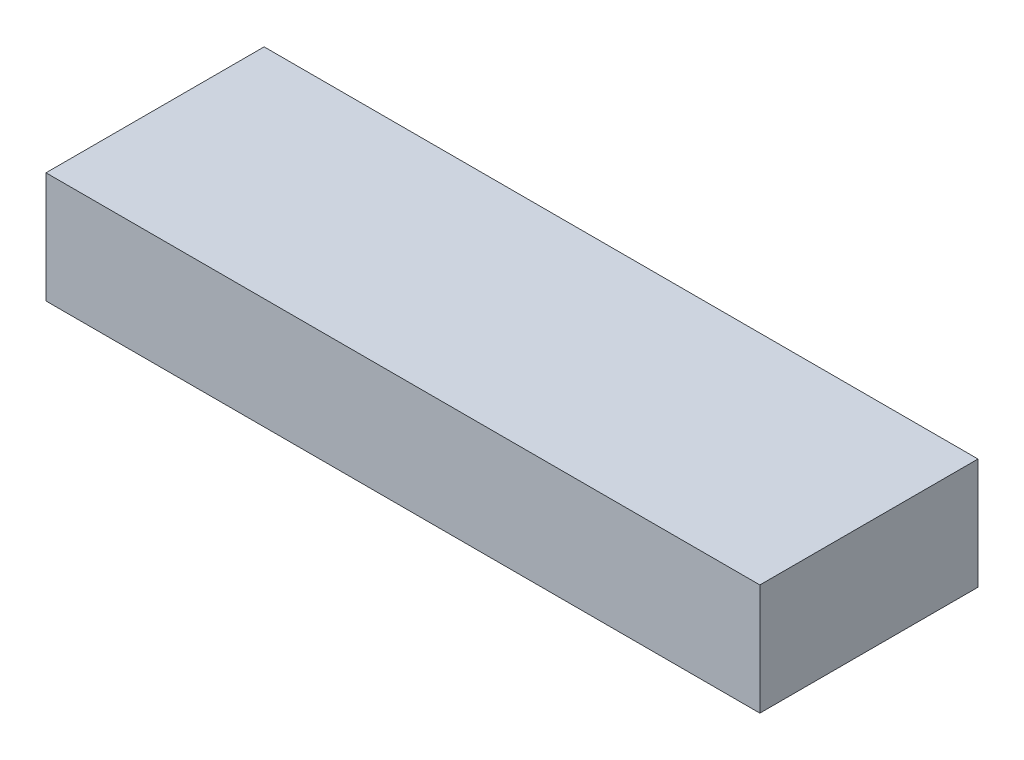
ISO-10303-21;
HEADER;
FILE_DESCRIPTION(('STEP AP214'),'2;1');
FILE_NAME('part.step','',(''),(''),'','','');
FILE_SCHEMA(('AUTOMOTIVE_DESIGN { 1 0 10303 214 1 1 1 1 }'));
ENDSEC;
DATA;
#1=APPLICATION_CONTEXT('core data for automotive mechanical design processes');
#2=APPLICATION_PROTOCOL_DEFINITION('international standard','automotive_design',2000,#1);
#3=PRODUCT_CONTEXT('',#1,'mechanical');
#4=PRODUCT('Part','Part','',(#3));
#5=PRODUCT_RELATED_PRODUCT_CATEGORY('part','',(#4));
#6=PRODUCT_DEFINITION_FORMATION('','',#4);
#7=PRODUCT_DEFINITION_CONTEXT('part definition',#1,'design');
#8=PRODUCT_DEFINITION('design','',#6,#7);
#9=PRODUCT_DEFINITION_SHAPE('','',#8);
#10=(LENGTH_UNIT() NAMED_UNIT(*) SI_UNIT(.MILLI.,.METRE.));
#11=(NAMED_UNIT(*) PLANE_ANGLE_UNIT() SI_UNIT($,.RADIAN.));
#12=(NAMED_UNIT(*) SI_UNIT($,.STERADIAN.) SOLID_ANGLE_UNIT());
#13=UNCERTAINTY_MEASURE_WITH_UNIT(LENGTH_MEASURE(1.E-05),#10,'distance_accuracy_value','');
#14=(GEOMETRIC_REPRESENTATION_CONTEXT(3) GLOBAL_UNCERTAINTY_ASSIGNED_CONTEXT((#13)) GLOBAL_UNIT_ASSIGNED_CONTEXT((#10,
#11,#12)) REPRESENTATION_CONTEXT('',''));
#15=CARTESIAN_POINT('',(0.,0.,0.));
#16=DIRECTION('',(0.,0.,1.));
#17=DIRECTION('',(1.,0.,0.));
#18=AXIS2_PLACEMENT_3D('',#15,#16,#17);
#19=CARTESIAN_POINT('',(0.,263.525,0.));
#20=DIRECTION('',(0.,1.,0.));
#21=DIRECTION('',(0.,0.,1.));
#22=AXIS2_PLACEMENT_3D('',#19,#20,#21);
#23=PLANE('',#22);
#24=DIRECTION('',(1.,0.,0.));
#25=VECTOR('',#24,1.);
#26=CARTESIAN_POINT('',(241.253264434507,263.525,0.));
#27=LINE('',#26,#25);
#28=CARTESIAN_POINT('',(60.,263.525,0.));
#29=VERTEX_POINT('',#28);
#30=CARTESIAN_POINT('',(240.,263.525,0.));
#31=VERTEX_POINT('',#30);
#32=EDGE_CURVE('E38',#29,#31,#27,.T.);
#33=ORIENTED_EDGE('',*,*,#32,.T.);
#34=DIRECTION('',(0.,0.,-1.));
#35=VECTOR('',#34,1.);
#36=CARTESIAN_POINT('',(240.,263.525,0.));
#37=LINE('',#36,#35);
#38=CARTESIAN_POINT('',(240.,263.525,54.9999999999999));
#39=VERTEX_POINT('',#38);
#40=EDGE_CURVE('E119',#39,#31,#37,.T.);
#41=ORIENTED_EDGE('',*,*,#40,.F.);
#42=DIRECTION('',(1.,0.,0.));
#43=VECTOR('',#42,1.);
#44=CARTESIAN_POINT('',(240.,263.525,54.9999999999999));
#45=LINE('',#44,#43);
#46=CARTESIAN_POINT('',(60.0000000000001,263.525,55.));
#47=VERTEX_POINT('',#46);
#48=EDGE_CURVE('E115',#47,#39,#45,.T.);
#49=ORIENTED_EDGE('',*,*,#48,.F.);
#50=DIRECTION('',(0.,0.,1.));
#51=VECTOR('',#50,1.);
#52=CARTESIAN_POINT('',(60.0000000000001,263.525,55.));
#53=LINE('',#52,#51);
#54=EDGE_CURVE('E176',#29,#47,#53,.T.);
#55=ORIENTED_EDGE('',*,*,#54,.F.);
#56=EDGE_LOOP('',(#33,#41,#49,#55));
#57=FACE_BOUND('',#56,.T.);
#58=CARTESIAN_POINT('',(128.409183393375,263.525,37.2754741948869));
#59=CARTESIAN_POINT('',(128.935315344216,263.525,37.2634224363284));
#60=CARTESIAN_POINT('',(129.461491505504,263.525,37.2535435033356));
#61=CARTESIAN_POINT('',(130.513852839061,263.525,37.237426466283));
#62=CARTESIAN_POINT('',(131.040038006218,263.525,37.2311880332933));
#63=CARTESIAN_POINT('',(132.092412602007,263.525,37.2216454362855));
#64=CARTESIAN_POINT('',(132.61860202968,263.525,37.2183411582906));
#65=CARTESIAN_POINT('',(133.670985228738,263.525,37.2140483026083));
#66=CARTESIAN_POINT('',(134.19717900005,263.525,37.2130597054449));
#67=CARTESIAN_POINT('',(135.249572115499,263.525,37.2128345851069));
#68=CARTESIAN_POINT('',(135.775771459634,263.525,37.2135980813797));
#69=CARTESIAN_POINT('',(136.828173533466,263.525,37.2163711429077));
#70=CARTESIAN_POINT('',(137.354376263115,263.525,37.2183807248162));
#71=CARTESIAN_POINT('',(138.406783389086,263.525,37.2231925593134));
#72=CARTESIAN_POINT('',(138.932987785367,263.525,37.2259948201963));
#73=CARTESIAN_POINT('',(139.985396245271,263.525,37.2319931499325));
#74=CARTESIAN_POINT('',(140.511600308883,263.525,37.2351892202885));
#75=CARTESIAN_POINT('',(141.886491043867,263.525,37.2435928187358));
#76=CARTESIAN_POINT('',(142.735177525047,263.525,37.2488326767238));
#77=CARTESIAN_POINT('',(144.432556553816,263.525,37.2582425022373));
#78=CARTESIAN_POINT('',(145.281249101403,263.525,37.2624124701066));
#79=CARTESIAN_POINT('',(146.978632631595,263.525,37.2688930427409));
#80=CARTESIAN_POINT('',(147.827323614121,263.525,37.2712036674703));
#81=CARTESIAN_POINT('',(149.52470899831,263.525,37.2735609607826));
#82=CARTESIAN_POINT('',(150.373403399974,263.525,37.2736076291291));
#83=CARTESIAN_POINT('',(152.070797310421,263.525,37.271429254405));
#84=CARTESIAN_POINT('',(152.919496819173,263.525,37.2692041893922));
#85=CARTESIAN_POINT('',(154.616887765753,263.525,37.2628704112622));
#86=CARTESIAN_POINT('',(155.465579203586,263.525,37.2587616995014));
#87=CARTESIAN_POINT('',(157.162973220721,263.525,37.2494376641435));
#88=CARTESIAN_POINT('',(158.011675799885,263.525,37.2442223174891));
#89=CARTESIAN_POINT('',(159.709081238484,263.525,37.2338343237847));
#90=CARTESIAN_POINT('',(160.557784097918,263.525,37.228661676729));
#91=CARTESIAN_POINT('',(161.972290562856,263.525,37.2213439100927));
#92=CARTESIAN_POINT('',(162.538091764272,263.525,37.2187643559831));
#93=CARTESIAN_POINT('',(163.669696230646,263.525,37.2148419638552));
#94=CARTESIAN_POINT('',(164.235499495582,263.525,37.2134991201338));
#95=CARTESIAN_POINT('',(165.367101258372,263.525,37.2126551063442));
#96=CARTESIAN_POINT('',(165.9328997562,263.525,37.2131539137987));
#97=CARTESIAN_POINT('',(167.064516610619,263.525,37.2166755781878));
#98=CARTESIAN_POINT('',(167.630334966877,263.525,37.219698555104));
#99=CARTESIAN_POINT('',(168.761954151257,263.525,37.2290223167449));
#100=CARTESIAN_POINT('',(169.327754979074,263.525,37.2353231422159));
#101=CARTESIAN_POINT('',(170.459326126803,263.525,37.2520713840699));
#102=CARTESIAN_POINT('',(171.025096443194,263.525,37.2625190343745));
#103=CARTESIAN_POINT('',(171.590816606616,263.525,37.2754741948862));
#104=B_SPLINE_CURVE_WITH_KNOTS('',3,(#58,#59,#60,#61,#62,#63,#64,#65,#66,#67,#68,#69,#70,#71,
#72,#73,#74,#75,#76,#77,#78,#79,#80,#81,#82,#83,#84,#85,#86,#87,#88,#89,#90,#91,#92,#93,#94,#95,
#96,#97,#98,#99,#100,#101,#102,#103),.UNSPECIFIED.,.F.,.F.,(4,2,2,2,2,2,2,2,2,2,2,2,2,2,2,2,2,2,
2,2,2,2,4),(0.,1.57879740934248,3.1574521475984,4.73604556052074,6.31462569662369,
7.89322335427828,9.47184210937685,11.0504773829365,12.6291186801294,15.1752265693772,
17.7213336406751,20.2674133730744,22.8134933712835,25.3595979617897,27.9057007187842,
30.4518565303839,32.9980120064225,34.6954324514137,36.3928450686892,38.0902369692669,
39.7877095567272,41.4852032456054,43.1827927034092),.UNSPECIFIED.);
#105=CARTESIAN_POINT('',(128.409183393374,263.525,37.2754741948869));
#106=VERTEX_POINT('',#105);
#107=CARTESIAN_POINT('',(171.590816606617,263.525,37.2754741948862));
#108=VERTEX_POINT('',#107);
#109=EDGE_CURVE('E43',#106,#108,#104,.T.);
#110=ORIENTED_EDGE('',*,*,#109,.T.);
#111=CARTESIAN_POINT('',(192.435987217564,263.525,33.0000000025184));
#112=CARTESIAN_POINT('',(192.436011088802,263.525,33.0434393153706));
#113=CARTESIAN_POINT('',(192.433856176102,263.525,33.08686429808));
#114=CARTESIAN_POINT('',(192.425375267438,263.525,33.1732424197555));
#115=CARTESIAN_POINT('',(192.419055448113,263.525,33.2161961618266));
#116=CARTESIAN_POINT('',(192.402545183961,263.525,33.3007307171293));
#117=CARTESIAN_POINT('',(192.392409485246,263.525,33.3423223025522));
#118=CARTESIAN_POINT('',(192.368567292052,263.525,33.4244716410908));
#119=CARTESIAN_POINT('',(192.354859356591,263.525,33.4650289697393));
#120=CARTESIAN_POINT('',(192.301511476489,263.525,33.6040140451591));
#121=CARTESIAN_POINT('',(192.253507947504,263.525,33.6992960167715));
#122=CARTESIAN_POINT('',(192.142841416342,263.525,33.8812901528896));
#123=CARTESIAN_POINT('',(192.080093419695,263.525,33.9679483186598));
#124=CARTESIAN_POINT('',(191.954284243189,263.525,34.1207884449622));
#125=CARTESIAN_POINT('',(191.892588833982,263.525,34.1881171948751));
#126=CARTESIAN_POINT('',(191.76361436149,263.525,34.3172409887717));
#127=CARTESIAN_POINT('',(191.69633098353,263.525,34.3790316786258));
#128=CARTESIAN_POINT('',(191.557507292685,263.525,34.4977629716423));
#129=CARTESIAN_POINT('',(191.485961852969,263.525,34.5546975247703));
#130=CARTESIAN_POINT('',(191.339676363574,263.525,34.6642181857243));
#131=CARTESIAN_POINT('',(191.264937266281,263.525,34.7168055763861));
#132=CARTESIAN_POINT('',(191.044517053055,263.525,34.8638515831894));
#133=CARTESIAN_POINT('',(190.895546915487,263.525,34.953381809466));
#134=CARTESIAN_POINT('',(190.591465649165,263.525,35.121723090095));
#135=CARTESIAN_POINT('',(190.436344420284,263.525,35.200515485043));
#136=CARTESIAN_POINT('',(190.121817517514,263.525,35.3493041042936));
#137=CARTESIAN_POINT('',(189.962408495746,263.525,35.4192931978977));
#138=CARTESIAN_POINT('',(189.639705637532,263.525,35.5522455571298));
#139=CARTESIAN_POINT('',(189.476395446229,263.525,35.6151687515782));
#140=CARTESIAN_POINT('',(189.147667328852,263.525,35.7346221830566));
#141=CARTESIAN_POINT('',(188.9822518683,263.525,35.7911592477392));
#142=CARTESIAN_POINT('',(188.649731164323,263.525,35.8987655906204));
#143=CARTESIAN_POINT('',(188.482626571709,263.525,35.9498368929843));
#144=CARTESIAN_POINT('',(188.090578275526,263.525,36.0636119881741));
#145=CARTESIAN_POINT('',(187.865093092547,263.525,36.1244472986276));
#146=CARTESIAN_POINT('',(187.412286167399,263.525,36.2389021600035));
#147=CARTESIAN_POINT('',(187.184964195884,263.525,36.2925207946019));
#148=CARTESIAN_POINT('',(186.728637477402,263.525,36.3935729941319));
#149=CARTESIAN_POINT('',(186.49963088723,263.525,36.4409981956179));
#150=CARTESIAN_POINT('',(186.040542547323,263.525,36.5303478237254));
#151=CARTESIAN_POINT('',(185.810460738945,263.525,36.5722719465985));
#152=CARTESIAN_POINT('',(185.118289882874,263.525,36.6908713714814));
#153=CARTESIAN_POINT('',(184.654941060859,263.525,36.760230551034));
#154=CARTESIAN_POINT('',(183.726117370076,263.525,36.8832723715313));
#155=CARTESIAN_POINT('',(183.260642037482,263.525,36.9369514085709));
#156=CARTESIAN_POINT('',(182.327633321121,263.525,37.031398365197));
#157=CARTESIAN_POINT('',(181.860097819882,263.525,37.0721451074196));
#158=CARTESIAN_POINT('',(180.92477699676,263.525,37.1426513582292));
#159=CARTESIAN_POINT('',(180.456992640789,263.525,37.1724239361714));
#160=CARTESIAN_POINT('',(179.521177447414,263.525,37.222679734808));
#161=CARTESIAN_POINT('',(179.053146862595,263.525,37.2431677516688));
#162=CARTESIAN_POINT('',(178.11682870838,263.525,37.276222912991));
#163=CARTESIAN_POINT('',(177.648541148668,263.525,37.2887903378332));
#164=CARTESIAN_POINT('',(176.868720646019,263.525,37.3040646799131));
#165=CARTESIAN_POINT('',(176.55722232422,263.525,37.3086644314647));
#166=CARTESIAN_POINT('',(175.934144765646,263.525,37.3151557165912));
#167=CARTESIAN_POINT('',(175.6225655241,263.525,37.3170467915974));
#168=CARTESIAN_POINT('',(174.9993723003,263.525,37.3183916086863));
#169=CARTESIAN_POINT('',(174.68775831762,263.525,37.3178451131127));
#170=CARTESIAN_POINT('',(174.066591723463,263.525,37.3145762343992));
#171=CARTESIAN_POINT('',(173.7570390334,263.525,37.3118681852725));
#172=CARTESIAN_POINT('',(173.137988594077,263.525,37.3045255586765));
#173=CARTESIAN_POINT('',(172.82849084243,263.525,37.2998911770294));
#174=CARTESIAN_POINT('',(172.209594792562,263.525,37.2889117740157));
#175=CARTESIAN_POINT('',(171.900196487588,263.525,37.2825671358309));
#176=CARTESIAN_POINT('',(171.590816606617,263.525,37.2754741948861));
#177=B_SPLINE_CURVE_WITH_KNOTS('',3,(#111,#112,#113,#114,#115,#116,#117,#118,#119,#120,#121,
#122,#123,#124,#125,#126,#127,#128,#129,#130,#131,#132,#133,#134,#135,#136,#137,#138,#139,#140,
#141,#142,#143,#144,#145,#146,#147,#148,#149,#150,#151,#152,#153,#154,#155,#156,#157,#158,#159,
#160,#161,#162,#163,#164,#165,#166,#167,#168,#169,#170,#171,#172,#173,#174,#175,#176),
.UNSPECIFIED.,.F.,.F.,(4,2,2,2,2,2,2,2,2,2,2,2,2,2,2,2,2,2,2,2,2,2,2,2,2,2,2,2,2,2,2,2,4),(0.,
0.130241429364157,0.260290141443698,0.388540068376575,0.516841809550153,0.834941817756816,
1.15492255672254,1.42848738000307,1.70226543229465,1.97637973595619,2.25041285831362,
2.77116249270016,3.29280581231198,3.81486898006165,4.33975738168852,4.86407918468506,
5.38820613589385,6.08869943050761,6.78928158522914,7.4908002146554,8.19235756294127,
9.5975130980863,11.0029913388343,12.4107593945532,13.8168454520471,15.2222043311899,
16.6275134592834,17.5620991178346,18.4968429794914,19.431677977976,20.3603647546448,
21.2889571482922,22.2173416641275),.UNSPECIFIED.);
#178=CARTESIAN_POINT('',(192.435987217562,263.525000000001,33.0000000025184));
#179=VERTEX_POINT('',#178);
#180=EDGE_CURVE('E136',#179,#108,#177,.T.);
#181=ORIENTED_EDGE('',*,*,#180,.F.);
#182=DIRECTION('',(0.,0.,1.));
#183=VECTOR('',#182,1.);
#184=CARTESIAN_POINT('',(192.435987217565,263.525,200.400182821006));
#185=LINE('',#184,#183);
#186=CARTESIAN_POINT('',(192.435987217564,263.525,3.00000000251837));
#187=VERTEX_POINT('',#186);
#188=EDGE_CURVE('E121',#187,#179,#185,.T.);
#189=ORIENTED_EDGE('',*,*,#188,.F.);
#190=DIRECTION('',(-1.,0.,0.));
#191=VECTOR('',#190,1.);
#192=CARTESIAN_POINT('',(149.999999999995,263.525,3.00000000251911));
#193=LINE('',#192,#191);
#194=CARTESIAN_POINT('',(107.564012782426,263.525,3.00000000251986));
#195=VERTEX_POINT('',#194);
#196=EDGE_CURVE('E11',#187,#195,#193,.T.);
#197=ORIENTED_EDGE('',*,*,#196,.T.);
#198=DIRECTION('',(0.,0.,1.));
#199=VECTOR('',#198,1.);
#200=CARTESIAN_POINT('',(107.564012782432,263.525,200.400182821008));
#201=LINE('',#200,#199);
#202=CARTESIAN_POINT('',(107.564012782429,263.525000000001,33.0000000025199));
#203=VERTEX_POINT('',#202);
#204=EDGE_CURVE('E56',#203,#195,#201,.F.);
#205=ORIENTED_EDGE('',*,*,#204,.F.);
#206=CARTESIAN_POINT('',(128.409183393374,263.525,37.2754741948868));
#207=CARTESIAN_POINT('',(128.051894710239,263.525,37.2836641761605));
#208=CARTESIAN_POINT('',(127.6945808691,263.525,37.2908580436216));
#209=CARTESIAN_POINT('',(126.979800252876,263.525,37.3029213767301));
#210=CARTESIAN_POINT('',(126.622333465375,263.525,37.3077900998672));
#211=CARTESIAN_POINT('',(125.907308636066,263.525,37.3148659469851));
#212=CARTESIAN_POINT('',(125.549750589352,263.525,37.3170725961095));
#213=CARTESIAN_POINT('',(124.834606252839,263.525,37.3184574758383));
#214=CARTESIAN_POINT('',(124.477019962629,263.525,37.3176355252875));
#215=CARTESIAN_POINT('',(123.760859504184,263.525,37.3125603889058));
#216=CARTESIAN_POINT('',(123.402285400806,263.525,37.3082975102587));
#217=CARTESIAN_POINT('',(122.685229894357,263.525,37.2958901570463));
#218=CARTESIAN_POINT('',(122.326748486316,263.525,37.2877459769455));
#219=CARTESIAN_POINT('',(121.60994018102,263.525,37.2670886446054));
#220=CARTESIAN_POINT('',(121.251613273173,263.525,37.2545758660324));
#221=CARTESIAN_POINT('',(120.53517713601,263.525,37.2246302296394));
#222=CARTESIAN_POINT('',(120.177067898286,263.525,37.2071975758378));
#223=CARTESIAN_POINT('',(119.472458511016,263.525,37.1674163274857));
#224=CARTESIAN_POINT('',(119.125948714547,263.525,37.1452402692858));
#225=CARTESIAN_POINT('',(118.433337233113,263.525,37.0950078689188));
#226=CARTESIAN_POINT('',(118.087235565238,263.525,37.0669512887018));
#227=CARTESIAN_POINT('',(117.39558596318,263.525,37.0041603520604));
#228=CARTESIAN_POINT('',(117.050038109821,263.525,36.9694250971018));
#229=CARTESIAN_POINT('',(116.359590004402,263.525,36.8922968555982));
#230=CARTESIAN_POINT('',(116.014690234281,263.525,36.8498995114988));
#231=CARTESIAN_POINT('',(115.326116320868,263.525,36.7562713772811));
#232=CARTESIAN_POINT('',(114.982442058973,263.525,36.7050414670269));
#233=CARTESIAN_POINT('',(114.296852999469,263.525,36.5922400283021));
#234=CARTESIAN_POINT('',(113.954937812492,263.525,36.5306708997104));
#235=CARTESIAN_POINT('',(113.342578387325,263.525,36.4088892849372));
#236=CARTESIAN_POINT('',(113.071688159953,263.525,36.350928985456));
#237=CARTESIAN_POINT('',(112.531986217608,263.525,36.2257654929522));
#238=CARTESIAN_POINT('',(112.263174825383,263.525,36.1585608939787));
#239=CARTESIAN_POINT('',(111.729479500192,263.525,36.0133604224585));
#240=CARTESIAN_POINT('',(111.464584999961,263.525,35.9354037755901));
#241=CARTESIAN_POINT('',(110.939177098807,263.525,35.7660655485733));
#242=CARTESIAN_POINT('',(110.678661894095,263.525,35.6746896545641));
#243=CARTESIAN_POINT('',(110.223056142982,263.525,35.4977009565297));
#244=CARTESIAN_POINT('',(110.026636970608,263.525,35.4155548510646));
#245=CARTESIAN_POINT('',(109.735818493693,263.525,35.2826000075541));
#246=CARTESIAN_POINT('',(109.639255498186,263.525,35.2365197732933));
#247=CARTESIAN_POINT('',(109.447949554132,263.525,35.1407358617284));
#248=CARTESIAN_POINT('',(109.35320641394,263.525,35.091032568634));
#249=CARTESIAN_POINT('',(109.138333573493,263.525,34.9722147119986));
#250=CARTESIAN_POINT('',(109.018968390922,263.525,34.9017020260968));
#251=CARTESIAN_POINT('',(108.785349757699,263.525,34.7522949595584));
#252=CARTESIAN_POINT('',(108.671101925771,263.525,34.6733916720582));
#253=CARTESIAN_POINT('',(108.450989762533,263.525,34.506097782546));
#254=CARTESIAN_POINT('',(108.345070978818,263.525,34.4177796013186));
#255=CARTESIAN_POINT('',(108.144622993734,263.525,34.2291331654217));
#256=CARTESIAN_POINT('',(108.050062419983,263.525,34.1288395928631));
#257=CARTESIAN_POINT('',(107.935041881477,263.525,33.9848109789745));
#258=CARTESIAN_POINT('',(107.906759946686,263.525,33.9472762981489));
#259=CARTESIAN_POINT('',(107.852620597751,263.525,33.8704851403311));
#260=CARTESIAN_POINT('',(107.826763127543,263.525,33.8312287031852));
#261=CARTESIAN_POINT('',(107.777981826993,263.525,33.7511543108066));
#262=CARTESIAN_POINT('',(107.755045988739,263.525,33.7103437059798));
#263=CARTESIAN_POINT('',(107.712426164581,263.525,33.6270452176555));
#264=CARTESIAN_POINT('',(107.692742285601,263.525,33.584557279064));
#265=CARTESIAN_POINT('',(107.657416466249,263.525,33.4987945123038));
#266=CARTESIAN_POINT('',(107.641709629132,263.525,33.4555465963542));
#267=CARTESIAN_POINT('',(107.61433987614,263.525,33.367798178957));
#268=CARTESIAN_POINT('',(107.602675383712,263.525,33.3232981731746));
#269=CARTESIAN_POINT('',(107.583625199713,263.525,33.2326422484606));
#270=CARTESIAN_POINT('',(107.576310440143,263.525,33.1864712531426));
#271=CARTESIAN_POINT('',(107.566483790554,263.525,33.093540588437));
#272=CARTESIAN_POINT('',(107.563980524835,263.525,33.0467800129328));
#273=CARTESIAN_POINT('',(107.564012782427,263.525,33.0000000025199));
#274=B_SPLINE_CURVE_WITH_KNOTS('',3,(#206,#207,#208,#209,#210,#211,#212,#213,#214,#215,#216,
#217,#218,#219,#220,#221,#222,#223,#224,#225,#226,#227,#228,#229,#230,#231,#232,#233,#234,#235,
#236,#237,#238,#239,#240,#241,#242,#243,#244,#245,#246,#247,#248,#249,#250,#251,#252,#253,#254,
#255,#256,#257,#258,#259,#260,#261,#262,#263,#264,#265,#266,#267,#268,#269,#270,#271,#272,#273),
.UNSPECIFIED.,.F.,.F.,(4,2,2,2,2,2,2,2,2,2,2,2,2,2,2,2,2,2,2,2,2,2,2,2,2,2,2,2,2,2,2,2,2,4),(0.,
1.07214969800926,2.14464154708534,3.21732467720169,4.29007197070426,5.36585169632604,
6.44154981826362,7.51715595332175,8.59271749148728,9.63432970381734,10.6759840898922,
11.7177787160515,12.7601677029906,13.802452911334,14.8444965240809,15.6754296450747,
16.5064892813857,17.3345935148826,18.1623478627303,18.8006703086957,19.1215899108674,
19.4424755302602,19.8581120492394,20.2741942678702,20.6872798417487,21.0991968367766,
21.2401141352356,21.3810281741905,21.5213429653124,21.6616623690712,21.799518187145,
21.9373201794314,22.0773117464936,22.2175540064837),.UNSPECIFIED.);
#275=EDGE_CURVE('E129',#106,#203,#274,.T.);
#276=ORIENTED_EDGE('',*,*,#275,.F.);
#277=EDGE_LOOP('',(#110,#181,#189,#197,#205,#276));
#278=FACE_BOUND('',#277,.T.);
#279=ADVANCED_FACE('F34',(#57,#278),#23,.F.);
#280=CARTESIAN_POINT('',(283.519735499998,131.762500000001,37.2754741948838));
#281=CARTESIAN_POINT('',(278.834697888002,131.762500000001,36.6110517302186));
#282=CARTESIAN_POINT('',(276.302452499998,131.762500000001,40.0406980173928));
#283=CARTESIAN_POINT('',(276.302452499998,131.762500000001,43.5629362424831));
#284=(BOUNDED_CURVE() B_SPLINE_CURVE(3,(#280,#281,#282,#283),.UNSPECIFIED.,.F.,
.F.) B_SPLINE_CURVE_WITH_KNOTS((4,4),(0.,1.),
.UNSPECIFIED.) CURVE() GEOMETRIC_REPRESENTATION_ITEM() RATIONAL_B_SPLINE_CURVE((0.255591691964593,
0.242825015050018,0.327183181081988,0.508666190060503)) REPRESENTATION_ITEM(''));
#285=CARTESIAN_POINT('',(149.999999999999,131.7625,200.400182821007));
#286=DIRECTION('',(0.,0.,1.));
#287=AXIS1_PLACEMENT('',#285,#286);
#288=SURFACE_OF_REVOLUTION('',#284,#287);
#289=ORIENTED_EDGE('',*,*,#109,.F.);
#290=CARTESIAN_POINT('',(149.999999999996,131.762500000001,37.2754741948861));
#291=DIRECTION('',(0.,0.,1.));
#292=DIRECTION('',(1.,0.,0.));
#293=AXIS2_PLACEMENT_3D('',#290,#291,#292);
#294=CIRCLE('',#293,133.519735500002);
#295=EDGE_CURVE('E169',#108,#106,#294,.T.);
#296=ORIENTED_EDGE('',*,*,#295,.F.);
#297=EDGE_LOOP('',(#289,#296));
#298=FACE_BOUND('',#297,.T.);
#299=ADVANCED_FACE('F148',(#298),#288,.F.);
#300=CARTESIAN_POINT('',(283.519735499998,131.762500000001,37.2754741948837));
#301=CARTESIAN_POINT('',(286.705561076155,131.762500000001,37.7272814708559));
#302=CARTESIAN_POINT('',(288.427487939998,131.762500000001,35.3951219955774));
#303=CARTESIAN_POINT('',(288.427487939998,131.762500000001,33.0000000025163));
#304=(BOUNDED_CURVE() B_SPLINE_CURVE(3,(#300,#301,#302,#303),.UNSPECIFIED.,.F.,
.F.) B_SPLINE_CURVE_WITH_KNOTS((4,4),(0.,1.),
.UNSPECIFIED.) CURVE() GEOMETRIC_REPRESENTATION_ITEM() RATIONAL_B_SPLINE_CURVE((0.255591691964592,
0.242825015050017,0.327183181081988,0.508666190060503)) REPRESENTATION_ITEM(''));
#305=CARTESIAN_POINT('',(149.999999999999,131.7625,200.400182821007));
#306=DIRECTION('',(0.,0.,1.));
#307=AXIS1_PLACEMENT('',#305,#306);
#308=SURFACE_OF_REVOLUTION('',#304,#307);
#309=CARTESIAN_POINT('',(149.999999999996,131.762500000001,33.0000000025187));
#310=DIRECTION('',(0.,0.,1.));
#311=DIRECTION('',(1.,0.,0.));
#312=AXIS2_PLACEMENT_3D('',#309,#310,#311);
#313=CIRCLE('',#312,138.427487940002);
#314=EDGE_CURVE('E167',#179,#203,#313,.T.);
#315=ORIENTED_EDGE('',*,*,#314,.F.);
#316=ORIENTED_EDGE('',*,*,#180,.T.);
#317=ORIENTED_EDGE('',*,*,#295,.T.);
#318=ORIENTED_EDGE('',*,*,#275,.T.);
#319=EDGE_LOOP('',(#315,#316,#317,#318));
#320=FACE_BOUND('',#319,.T.);
#321=ADVANCED_FACE('F141',(#320),#308,.T.);
#322=CARTESIAN_POINT('',(149.999999999999,131.7625,200.400182821007));
#323=DIRECTION('',(0.,0.,1.));
#324=DIRECTION('',(1.,0.,0.));
#325=AXIS2_PLACEMENT_3D('',#322,#323,#324);
#326=CYLINDRICAL_SURFACE('',#325,138.427487940002);
#327=ORIENTED_EDGE('',*,*,#314,.T.);
#328=ORIENTED_EDGE('',*,*,#204,.T.);
#329=CARTESIAN_POINT('',(149.999999999995,131.762500000001,3.00000000251865));
#330=DIRECTION('',(0.,0.,1.));
#331=DIRECTION('',(1.,0.,0.));
#332=AXIS2_PLACEMENT_3D('',#329,#330,#331);
#333=CIRCLE('',#332,138.427487940002);
#334=EDGE_CURVE('E162',#187,#195,#333,.T.);
#335=ORIENTED_EDGE('',*,*,#334,.F.);
#336=ORIENTED_EDGE('',*,*,#188,.T.);
#337=EDGE_LOOP('',(#327,#328,#335,#336));
#338=FACE_BOUND('',#337,.T.);
#339=ADVANCED_FACE('F147',(#338),#326,.F.);
#340=CARTESIAN_POINT('',(149.999999999995,131.762500000001,3.00000000251865));
#341=DIRECTION('',(0.,0.,1.));
#342=DIRECTION('',(1.,0.,0.));
#343=AXIS2_PLACEMENT_3D('',#340,#341,#342);
#344=PLANE('',#343);
#345=ORIENTED_EDGE('',*,*,#196,.F.);
#346=ORIENTED_EDGE('',*,*,#334,.T.);
#347=EDGE_LOOP('',(#345,#346));
#348=FACE_BOUND('',#347,.T.);
#349=ADVANCED_FACE('F209',(#348),#344,.T.);
#350=CARTESIAN_POINT('',(241.253264434507,233.525,0.));
#351=DIRECTION('',(0.,0.,-1.));
#352=DIRECTION('',(-1.,0.,0.));
#353=AXIS2_PLACEMENT_3D('',#350,#351,#352);
#354=PLANE('',#353);
#355=ORIENTED_EDGE('',*,*,#32,.F.);
#356=DIRECTION('',(0.,-1.,0.));
#357=VECTOR('',#356,1.);
#358=CARTESIAN_POINT('',(60.,291.525,0.));
#359=LINE('',#358,#357);
#360=CARTESIAN_POINT('',(60.,291.525,0.));
#361=VERTEX_POINT('',#360);
#362=EDGE_CURVE('E102',#361,#29,#359,.T.);
#363=ORIENTED_EDGE('',*,*,#362,.F.);
#364=DIRECTION('',(-1.,0.,0.));
#365=VECTOR('',#364,1.);
#366=CARTESIAN_POINT('',(60.,291.525,0.));
#367=LINE('',#366,#365);
#368=CARTESIAN_POINT('',(240.,291.525,0.));
#369=VERTEX_POINT('',#368);
#370=EDGE_CURVE('E95',#369,#361,#367,.T.);
#371=ORIENTED_EDGE('',*,*,#370,.F.);
#372=DIRECTION('',(0.,-1.,0.));
#373=VECTOR('',#372,1.);
#374=CARTESIAN_POINT('',(240.,291.525,0.));
#375=LINE('',#374,#373);
#376=EDGE_CURVE('E100',#369,#31,#375,.T.);
#377=ORIENTED_EDGE('',*,*,#376,.T.);
#378=EDGE_LOOP('',(#355,#363,#371,#377));
#379=FACE_BOUND('',#378,.T.);
#380=ADVANCED_FACE('F98',(#379),#354,.T.);
#381=CARTESIAN_POINT('',(60.0000000000001,291.525,55.));
#382=DIRECTION('',(1.,0.,0.));
#383=DIRECTION('',(0.,0.,-1.));
#384=AXIS2_PLACEMENT_3D('',#381,#382,#383);
#385=PLANE('',#384);
#386=ORIENTED_EDGE('',*,*,#54,.T.);
#387=DIRECTION('',(0.,-1.,0.));
#388=VECTOR('',#387,1.);
#389=CARTESIAN_POINT('',(60.0000000000001,291.525,55.));
#390=LINE('',#389,#388);
#391=CARTESIAN_POINT('',(60.0000000000001,291.525,55.));
#392=VERTEX_POINT('',#391);
#393=EDGE_CURVE('E124',#392,#47,#390,.T.);
#394=ORIENTED_EDGE('',*,*,#393,.F.);
#395=DIRECTION('',(0.,0.,1.));
#396=VECTOR('',#395,1.);
#397=CARTESIAN_POINT('',(60.0000000000001,291.525,55.));
#398=LINE('',#397,#396);
#399=EDGE_CURVE('E105',#361,#392,#398,.T.);
#400=ORIENTED_EDGE('',*,*,#399,.F.);
#401=ORIENTED_EDGE('',*,*,#362,.T.);
#402=EDGE_LOOP('',(#386,#394,#400,#401));
#403=FACE_BOUND('',#402,.T.);
#404=ADVANCED_FACE('F185',(#403),#385,.F.);
#405=CARTESIAN_POINT('',(0.,291.525,0.));
#406=DIRECTION('',(0.,-1.,0.));
#407=DIRECTION('',(0.,0.,-1.));
#408=AXIS2_PLACEMENT_3D('',#405,#406,#407);
#409=PLANE('',#408);
#410=DIRECTION('',(0.,0.,-1.));
#411=VECTOR('',#410,1.);
#412=CARTESIAN_POINT('',(240.,291.525,0.));
#413=LINE('',#412,#411);
#414=CARTESIAN_POINT('',(240.,291.525,54.9999999999999));
#415=VERTEX_POINT('',#414);
#416=EDGE_CURVE('E106',#415,#369,#413,.T.);
#417=ORIENTED_EDGE('',*,*,#416,.T.);
#418=ORIENTED_EDGE('',*,*,#370,.T.);
#419=ORIENTED_EDGE('',*,*,#399,.T.);
#420=DIRECTION('',(1.,0.,0.));
#421=VECTOR('',#420,1.);
#422=CARTESIAN_POINT('',(240.,291.525,54.9999999999999));
#423=LINE('',#422,#421);
#424=EDGE_CURVE('E111',#392,#415,#423,.T.);
#425=ORIENTED_EDGE('',*,*,#424,.T.);
#426=EDGE_LOOP('',(#417,#418,#419,#425));
#427=FACE_BOUND('',#426,.T.);
#428=ADVANCED_FACE('F109',(#427),#409,.F.);
#429=CARTESIAN_POINT('',(240.,291.525,0.));
#430=DIRECTION('',(-1.,0.,0.));
#431=DIRECTION('',(0.,0.,1.));
#432=AXIS2_PLACEMENT_3D('',#429,#430,#431);
#433=PLANE('',#432);
#434=ORIENTED_EDGE('',*,*,#40,.T.);
#435=ORIENTED_EDGE('',*,*,#376,.F.);
#436=ORIENTED_EDGE('',*,*,#416,.F.);
#437=DIRECTION('',(0.,-1.,0.));
#438=VECTOR('',#437,1.);
#439=CARTESIAN_POINT('',(240.,291.525,54.9999999999999));
#440=LINE('',#439,#438);
#441=EDGE_CURVE('E174',#415,#39,#440,.T.);
#442=ORIENTED_EDGE('',*,*,#441,.T.);
#443=EDGE_LOOP('',(#434,#435,#436,#442));
#444=FACE_BOUND('',#443,.T.);
#445=ADVANCED_FACE('F117',(#444),#433,.F.);
#446=CARTESIAN_POINT('',(240.,291.525,54.9999999999999));
#447=DIRECTION('',(0.,0.,-1.));
#448=DIRECTION('',(-1.,0.,0.));
#449=AXIS2_PLACEMENT_3D('',#446,#447,#448);
#450=PLANE('',#449);
#451=ORIENTED_EDGE('',*,*,#48,.T.);
#452=ORIENTED_EDGE('',*,*,#441,.F.);
#453=ORIENTED_EDGE('',*,*,#424,.F.);
#454=ORIENTED_EDGE('',*,*,#393,.T.);
#455=EDGE_LOOP('',(#451,#452,#453,#454));
#456=FACE_BOUND('',#455,.T.);
#457=ADVANCED_FACE('F182',(#456),#450,.F.);
#458=CLOSED_SHELL('',(#279,#299,#321,#339,#349,#380,#404,#428,#445,#457));
#459=MANIFOLD_SOLID_BREP('B2',#458);
#460=ADVANCED_BREP_SHAPE_REPRESENTATION('',(#18,#459),#14);
#461=SHAPE_DEFINITION_REPRESENTATION(#9,#460);
ENDSEC;
END-ISO-10303-21;
